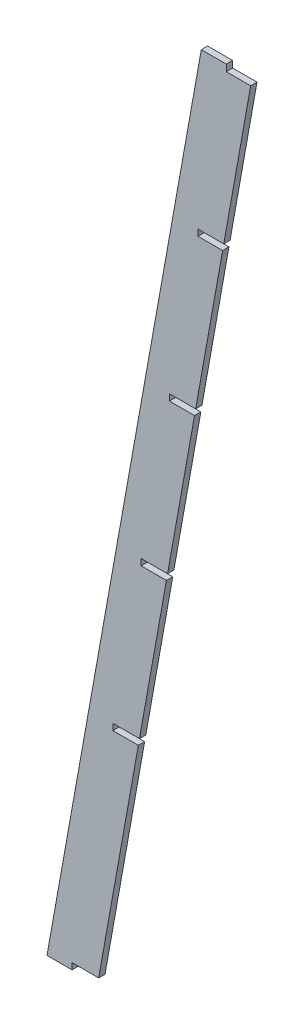
ISO-10303-21;
HEADER;
FILE_DESCRIPTION(('STEP AP214'),'2;1');
FILE_NAME('part.step','',(''),(''),'','','');
FILE_SCHEMA(('AUTOMOTIVE_DESIGN { 1 0 10303 214 1 1 1 1 }'));
ENDSEC;
DATA;
#1=APPLICATION_CONTEXT('core data for automotive mechanical design processes');
#2=APPLICATION_PROTOCOL_DEFINITION('international standard','automotive_design',2000,#1);
#3=PRODUCT_CONTEXT('',#1,'mechanical');
#4=PRODUCT('Part','Part','',(#3));
#5=PRODUCT_RELATED_PRODUCT_CATEGORY('part','',(#4));
#6=PRODUCT_DEFINITION_FORMATION('','',#4);
#7=PRODUCT_DEFINITION_CONTEXT('part definition',#1,'design');
#8=PRODUCT_DEFINITION('design','',#6,#7);
#9=PRODUCT_DEFINITION_SHAPE('','',#8);
#10=(LENGTH_UNIT() NAMED_UNIT(*) SI_UNIT(.MILLI.,.METRE.));
#11=(NAMED_UNIT(*) PLANE_ANGLE_UNIT() SI_UNIT($,.RADIAN.));
#12=(NAMED_UNIT(*) SI_UNIT($,.STERADIAN.) SOLID_ANGLE_UNIT());
#13=UNCERTAINTY_MEASURE_WITH_UNIT(LENGTH_MEASURE(1.E-05),#10,'distance_accuracy_value','');
#14=(GEOMETRIC_REPRESENTATION_CONTEXT(3) GLOBAL_UNCERTAINTY_ASSIGNED_CONTEXT((#13)) GLOBAL_UNIT_ASSIGNED_CONTEXT((#10,
#11,#12)) REPRESENTATION_CONTEXT('',''));
#15=CARTESIAN_POINT('',(0.,0.,0.));
#16=DIRECTION('',(0.,0.,1.));
#17=DIRECTION('',(1.,0.,0.));
#18=AXIS2_PLACEMENT_3D('',#15,#16,#17);
#19=CARTESIAN_POINT('',(24.6106079912229,-4.40765439654902,0.));
#20=DIRECTION('',(-0.984338140304232,0.17629074151074,0.));
#21=DIRECTION('',(-0.17629074151074,-0.984338140304232,0.));
#22=AXIS2_PLACEMENT_3D('',#19,#20,#21);
#23=PLANE('',#22);
#24=DIRECTION('',(0.17629074151074,0.984338140304232,0.));
#25=VECTOR('',#24,1.);
#26=CARTESIAN_POINT('',(25.4,0.,0.));
#27=LINE('',#26,#25);
#28=CARTESIAN_POINT('',(60.5412654139754,196.215,0.));
#29=VERTEX_POINT('',#28);
#30=CARTESIAN_POINT('',(74.0746330005872,271.78,0.));
#31=VERTEX_POINT('',#30);
#32=EDGE_CURVE('E409',#29,#31,#27,.T.);
#33=ORIENTED_EDGE('',*,*,#32,.F.);
#34=DIRECTION('',(0.,0.,1.));
#35=VECTOR('',#34,1.);
#36=CARTESIAN_POINT('',(60.5412654139754,196.215,-5.08));
#37=LINE('',#36,#35);
#38=CARTESIAN_POINT('',(60.5412654139754,196.215,-3.175));
#39=VERTEX_POINT('',#38);
#40=EDGE_CURVE('E647',#39,#29,#37,.T.);
#41=ORIENTED_EDGE('',*,*,#40,.F.);
#42=DIRECTION('',(0.17629074151074,0.984338140304232,0.));
#43=VECTOR('',#42,1.);
#44=CARTESIAN_POINT('',(25.4,0.,-3.175));
#45=LINE('',#44,#43);
#46=CARTESIAN_POINT('',(74.0746330005872,271.78,-3.175));
#47=VERTEX_POINT('',#46);
#48=EDGE_CURVE('E435',#39,#47,#45,.T.);
#49=ORIENTED_EDGE('',*,*,#48,.T.);
#50=DIRECTION('',(0.,0.,1.));
#51=VECTOR('',#50,1.);
#52=CARTESIAN_POINT('',(74.0746330005872,271.78,-5.08));
#53=LINE('',#52,#51);
#54=EDGE_CURVE('E571',#47,#31,#53,.T.);
#55=ORIENTED_EDGE('',*,*,#54,.T.);
#56=EDGE_LOOP('',(#33,#41,#49,#55));
#57=FACE_BOUND('',#56,.T.);
#58=ADVANCED_FACE('F53',(#57),#23,.F.);
#59=CARTESIAN_POINT('',(46.4392689371697,117.475,-3.175));
#60=VERTEX_POINT('',#59);
#61=CARTESIAN_POINT('',(59.9726365237816,193.04,-3.175));
#62=VERTEX_POINT('',#61);
#63=EDGE_CURVE('E426',#60,#62,#45,.T.);
#64=ORIENTED_EDGE('',*,*,#63,.T.);
#65=DIRECTION('',(0.,0.,1.));
#66=VECTOR('',#65,1.);
#67=CARTESIAN_POINT('',(59.9726365237816,193.04,-5.08));
#68=LINE('',#67,#66);
#69=CARTESIAN_POINT('',(59.9726365237816,193.04,0.));
#70=VERTEX_POINT('',#69);
#71=EDGE_CURVE('E671',#62,#70,#68,.T.);
#72=ORIENTED_EDGE('',*,*,#71,.T.);
#73=CARTESIAN_POINT('',(46.4392689371697,117.475,0.));
#74=VERTEX_POINT('',#73);
#75=EDGE_CURVE('E393',#74,#70,#27,.T.);
#76=ORIENTED_EDGE('',*,*,#75,.F.);
#77=DIRECTION('',(0.,0.,1.));
#78=VECTOR('',#77,1.);
#79=CARTESIAN_POINT('',(46.4392689371697,117.475,-5.08));
#80=LINE('',#79,#78);
#81=EDGE_CURVE('E593',#60,#74,#80,.T.);
#82=ORIENTED_EDGE('',*,*,#81,.F.);
#83=EDGE_LOOP('',(#64,#72,#76,#82));
#84=FACE_BOUND('',#83,.T.);
#85=ADVANCED_FACE('F541',(#84),#23,.F.);
#86=CARTESIAN_POINT('',(74.643261890781,274.955,0.));
#87=VERTEX_POINT('',#86);
#88=CARTESIAN_POINT('',(88.1900954272428,350.595188565884,0.));
#89=VERTEX_POINT('',#88);
#90=EDGE_CURVE('E412',#87,#89,#27,.T.);
#91=ORIENTED_EDGE('',*,*,#90,.F.);
#92=DIRECTION('',(0.,0.,1.));
#93=VECTOR('',#92,1.);
#94=CARTESIAN_POINT('',(74.643261890781,274.955,-5.08));
#95=LINE('',#94,#93);
#96=CARTESIAN_POINT('',(74.643261890781,274.955,-3.175));
#97=VERTEX_POINT('',#96);
#98=EDGE_CURVE('E599',#97,#87,#95,.T.);
#99=ORIENTED_EDGE('',*,*,#98,.F.);
#100=CARTESIAN_POINT('',(88.1900954272428,350.595188565884,-3.175));
#101=VERTEX_POINT('',#100);
#102=EDGE_CURVE('E444',#97,#101,#45,.T.);
#103=ORIENTED_EDGE('',*,*,#102,.T.);
#104=DIRECTION('',(0.,0.,1.));
#105=VECTOR('',#104,1.);
#106=CARTESIAN_POINT('',(88.1900954272428,350.595188565884,-5.08));
#107=LINE('',#106,#105);
#108=EDGE_CURVE('E613',#101,#89,#107,.T.);
#109=ORIENTED_EDGE('',*,*,#108,.T.);
#110=EDGE_LOOP('',(#91,#99,#103,#109));
#111=FACE_BOUND('',#110,.T.);
#112=ADVANCED_FACE('F546',(#111),#23,.F.);
#113=CARTESIAN_POINT('',(25.9686288901938,3.17500000000003,0.));
#114=VERTEX_POINT('',#113);
#115=CARTESIAN_POINT('',(45.8706400469759,114.3,0.));
#116=VERTEX_POINT('',#115);
#117=EDGE_CURVE('E387',#114,#116,#27,.T.);
#118=ORIENTED_EDGE('',*,*,#117,.F.);
#119=DIRECTION('',(0.,0.,1.));
#120=VECTOR('',#119,1.);
#121=CARTESIAN_POINT('',(25.9686288901938,3.17500000000003,-5.08));
#122=LINE('',#121,#120);
#123=CARTESIAN_POINT('',(25.9686288901938,3.17500000000003,-3.175));
#124=VERTEX_POINT('',#123);
#125=EDGE_CURVE('E237',#124,#114,#122,.T.);
#126=ORIENTED_EDGE('',*,*,#125,.F.);
#127=CARTESIAN_POINT('',(45.8706400469759,114.3,-3.175));
#128=VERTEX_POINT('',#127);
#129=EDGE_CURVE('E420',#124,#128,#45,.T.);
#130=ORIENTED_EDGE('',*,*,#129,.T.);
#131=DIRECTION('',(0.,0.,1.));
#132=VECTOR('',#131,1.);
#133=CARTESIAN_POINT('',(45.8706400469759,114.3,-5.08));
#134=LINE('',#133,#132);
#135=EDGE_CURVE('E560',#128,#116,#134,.T.);
#136=ORIENTED_EDGE('',*,*,#135,.T.);
#137=EDGE_LOOP('',(#118,#126,#130,#136));
#138=FACE_BOUND('',#137,.T.);
#139=ADVANCED_FACE('F550',(#138),#23,.F.);
#140=CARTESIAN_POINT('',(0.,432.562,0.));
#141=DIRECTION('',(0.,-1.,0.));
#142=DIRECTION('',(0.,0.,-1.));
#143=AXIS2_PLACEMENT_3D('',#140,#141,#142);
#144=PLANE('',#143);
#145=DIRECTION('',(1.,0.,0.));
#146=VECTOR('',#145,1.);
#147=CARTESIAN_POINT('',(77.47,432.562,0.));
#148=LINE('',#147,#146);
#149=CARTESIAN_POINT('',(77.47,432.562,0.));
#150=VERTEX_POINT('',#149);
#151=CARTESIAN_POINT('',(90.0287176521113,432.562,0.));
#152=VERTEX_POINT('',#151);
#153=EDGE_CURVE('E58',#150,#152,#148,.T.);
#154=ORIENTED_EDGE('',*,*,#153,.T.);
#155=DIRECTION('',(0.,0.,1.));
#156=VECTOR('',#155,1.);
#157=CARTESIAN_POINT('',(90.0287176521113,432.562,-5.08));
#158=LINE('',#157,#156);
#159=CARTESIAN_POINT('',(90.0287176521113,432.562,-3.175));
#160=VERTEX_POINT('',#159);
#161=EDGE_CURVE('E217',#160,#152,#158,.T.);
#162=ORIENTED_EDGE('',*,*,#161,.F.);
#163=DIRECTION('',(-1.,0.,0.));
#164=VECTOR('',#163,1.);
#165=CARTESIAN_POINT('',(77.47,432.562,-3.175));
#166=LINE('',#165,#164);
#167=CARTESIAN_POINT('',(77.47,432.562,-3.175));
#168=VERTEX_POINT('',#167);
#169=EDGE_CURVE('E245',#160,#168,#166,.T.);
#170=ORIENTED_EDGE('',*,*,#169,.T.);
#171=DIRECTION('',(0.,0.,1.));
#172=VECTOR('',#171,1.);
#173=CARTESIAN_POINT('',(77.47,432.562,0.));
#174=LINE('',#173,#172);
#175=EDGE_CURVE('E241',#168,#150,#174,.T.);
#176=ORIENTED_EDGE('',*,*,#175,.T.);
#177=EDGE_LOOP('',(#154,#162,#170,#176));
#178=FACE_BOUND('',#177,.T.);
#179=ADVANCED_FACE('F55',(#178),#144,.F.);
#180=CARTESIAN_POINT('',(0.,0.,0.));
#181=DIRECTION('',(0.,-1.,0.));
#182=DIRECTION('',(0.,0.,-1.));
#183=AXIS2_PLACEMENT_3D('',#180,#181,#182);
#184=PLANE('',#183);
#185=DIRECTION('',(0.,0.,1.));
#186=VECTOR('',#185,1.);
#187=CARTESIAN_POINT('',(12.5729093566815,0.,-5.08));
#188=LINE('',#187,#186);
#189=CARTESIAN_POINT('',(12.5729093566815,0.,-3.175));
#190=VERTEX_POINT('',#189);
#191=CARTESIAN_POINT('',(12.5729093566815,0.,0.));
#192=VERTEX_POINT('',#191);
#193=EDGE_CURVE('E474',#190,#192,#188,.T.);
#194=ORIENTED_EDGE('',*,*,#193,.T.);
#195=DIRECTION('',(1.,0.,0.));
#196=VECTOR('',#195,1.);
#197=CARTESIAN_POINT('',(0.,0.,0.));
#198=LINE('',#197,#196);
#199=CARTESIAN_POINT('',(0.,0.,0.));
#200=VERTEX_POINT('',#199);
#201=EDGE_CURVE('E265',#200,#192,#198,.T.);
#202=ORIENTED_EDGE('',*,*,#201,.F.);
#203=DIRECTION('',(0.,0.,1.));
#204=VECTOR('',#203,1.);
#205=CARTESIAN_POINT('',(0.,0.,0.));
#206=LINE('',#205,#204);
#207=CARTESIAN_POINT('',(0.,0.,-3.175));
#208=VERTEX_POINT('',#207);
#209=EDGE_CURVE('E290',#208,#200,#206,.T.);
#210=ORIENTED_EDGE('',*,*,#209,.F.);
#211=DIRECTION('',(-1.,0.,0.));
#212=VECTOR('',#211,1.);
#213=CARTESIAN_POINT('',(0.,0.,-3.175));
#214=LINE('',#213,#212);
#215=EDGE_CURVE('E272',#190,#208,#214,.T.);
#216=ORIENTED_EDGE('',*,*,#215,.F.);
#217=EDGE_LOOP('',(#194,#202,#210,#216));
#218=FACE_BOUND('',#217,.T.);
#219=ADVANCED_FACE('F292',(#218),#184,.T.);
#220=CARTESIAN_POINT('',(88.7529746008909,353.738084410876,-3.175));
#221=VERTEX_POINT('',#220);
#222=CARTESIAN_POINT('',(102.278625954198,429.26,-3.175));
#223=VERTEX_POINT('',#222);
#224=EDGE_CURVE('E271',#221,#223,#45,.T.);
#225=ORIENTED_EDGE('',*,*,#224,.T.);
#226=DIRECTION('',(0.,0.,1.));
#227=VECTOR('',#226,1.);
#228=CARTESIAN_POINT('',(102.278625954198,429.26,-5.08));
#229=LINE('',#228,#227);
#230=CARTESIAN_POINT('',(102.278625954198,429.26,0.));
#231=VERTEX_POINT('',#230);
#232=EDGE_CURVE('E454',#223,#231,#229,.T.);
#233=ORIENTED_EDGE('',*,*,#232,.T.);
#234=CARTESIAN_POINT('',(88.7529746008909,353.738084410876,0.));
#235=VERTEX_POINT('',#234);
#236=EDGE_CURVE('E404',#235,#231,#27,.T.);
#237=ORIENTED_EDGE('',*,*,#236,.F.);
#238=DIRECTION('',(0.,0.,1.));
#239=VECTOR('',#238,1.);
#240=CARTESIAN_POINT('',(88.7529746008909,353.738084410876,-5.08));
#241=LINE('',#240,#239);
#242=EDGE_CURVE('E455',#221,#235,#241,.T.);
#243=ORIENTED_EDGE('',*,*,#242,.F.);
#244=EDGE_LOOP('',(#225,#233,#237,#243));
#245=FACE_BOUND('',#244,.T.);
#246=ADVANCED_FACE('F302',(#245),#23,.F.);
#247=CARTESIAN_POINT('',(0.,0.,0.));
#248=DIRECTION('',(0.,0.,-1.));
#249=DIRECTION('',(-1.,0.,0.));
#250=AXIS2_PLACEMENT_3D('',#247,#248,#249);
#251=PLANE('',#250);
#252=ORIENTED_EDGE('',*,*,#236,.T.);
#253=DIRECTION('',(1.,0.,0.));
#254=VECTOR('',#253,1.);
#255=CARTESIAN_POINT('',(102.278625954198,429.26,0.));
#256=LINE('',#255,#254);
#257=CARTESIAN_POINT('',(90.0287176521113,429.26,0.));
#258=VERTEX_POINT('',#257);
#259=EDGE_CURVE('E227',#258,#231,#256,.T.);
#260=ORIENTED_EDGE('',*,*,#259,.F.);
#261=DIRECTION('',(0.,-1.,0.));
#262=VECTOR('',#261,1.);
#263=CARTESIAN_POINT('',(90.0287176521113,432.562,0.));
#264=LINE('',#263,#262);
#265=EDGE_CURVE('E220',#152,#258,#264,.T.);
#266=ORIENTED_EDGE('',*,*,#265,.F.);
#267=ORIENTED_EDGE('',*,*,#153,.F.);
#268=DIRECTION('',(0.17629074151074,0.984338140304232,0.));
#269=VECTOR('',#268,1.);
#270=CARTESIAN_POINT('',(0.,0.,0.));
#271=LINE('',#270,#269);
#272=EDGE_CURVE('E481',#200,#150,#271,.T.);
#273=ORIENTED_EDGE('',*,*,#272,.F.);
#274=ORIENTED_EDGE('',*,*,#201,.T.);
#275=DIRECTION('',(0.,-1.,0.));
#276=VECTOR('',#275,1.);
#277=CARTESIAN_POINT('',(12.5729093566815,3.17500000000003,0.));
#278=LINE('',#277,#276);
#279=CARTESIAN_POINT('',(12.5729093566815,3.17500000000003,0.));
#280=VERTEX_POINT('',#279);
#281=EDGE_CURVE('E567',#280,#192,#278,.T.);
#282=ORIENTED_EDGE('',*,*,#281,.F.);
#283=DIRECTION('',(-1.,0.,0.));
#284=VECTOR('',#283,1.);
#285=CARTESIAN_POINT('',(25.9686288901938,3.17500000000003,0.));
#286=LINE('',#285,#284);
#287=EDGE_CURVE('E566',#114,#280,#286,.T.);
#288=ORIENTED_EDGE('',*,*,#287,.F.);
#289=ORIENTED_EDGE('',*,*,#117,.T.);
#290=DIRECTION('',(1.,0.,0.));
#291=VECTOR('',#290,1.);
#292=CARTESIAN_POINT('',(33.0714242585586,114.3,0.));
#293=LINE('',#292,#291);
#294=CARTESIAN_POINT('',(33.0714242585586,114.3,0.));
#295=VERTEX_POINT('',#294);
#296=EDGE_CURVE('E564',#295,#116,#293,.T.);
#297=ORIENTED_EDGE('',*,*,#296,.F.);
#298=DIRECTION('',(0.,-1.,0.));
#299=VECTOR('',#298,1.);
#300=CARTESIAN_POINT('',(33.0714242585586,117.475,0.));
#301=LINE('',#300,#299);
#302=CARTESIAN_POINT('',(33.0714242585586,117.475,0.));
#303=VERTEX_POINT('',#302);
#304=EDGE_CURVE('E622',#303,#295,#301,.T.);
#305=ORIENTED_EDGE('',*,*,#304,.F.);
#306=DIRECTION('',(-1.,0.,0.));
#307=VECTOR('',#306,1.);
#308=CARTESIAN_POINT('',(46.4392689371697,117.475,0.));
#309=LINE('',#308,#307);
#310=EDGE_CURVE('E615',#74,#303,#309,.T.);
#311=ORIENTED_EDGE('',*,*,#310,.F.);
#312=ORIENTED_EDGE('',*,*,#75,.T.);
#313=DIRECTION('',(1.,0.,0.));
#314=VECTOR('',#313,1.);
#315=CARTESIAN_POINT('',(59.9726365237816,193.04,0.));
#316=LINE('',#315,#314);
#317=CARTESIAN_POINT('',(47.2603980488849,193.04,0.));
#318=VERTEX_POINT('',#317);
#319=EDGE_CURVE('E668',#318,#70,#316,.T.);
#320=ORIENTED_EDGE('',*,*,#319,.F.);
#321=DIRECTION('',(0.,-1.,0.));
#322=VECTOR('',#321,1.);
#323=CARTESIAN_POINT('',(47.2603980488849,193.04,0.));
#324=LINE('',#323,#322);
#325=CARTESIAN_POINT('',(47.2603980488849,196.215,0.));
#326=VERTEX_POINT('',#325);
#327=EDGE_CURVE('E678',#326,#318,#324,.T.);
#328=ORIENTED_EDGE('',*,*,#327,.F.);
#329=DIRECTION('',(-1.,0.,0.));
#330=VECTOR('',#329,1.);
#331=CARTESIAN_POINT('',(47.2603980488849,196.215,0.));
#332=LINE('',#331,#330);
#333=EDGE_CURVE('E470',#29,#326,#332,.T.);
#334=ORIENTED_EDGE('',*,*,#333,.F.);
#335=ORIENTED_EDGE('',*,*,#32,.T.);
#336=DIRECTION('',(1.,0.,0.));
#337=VECTOR('',#336,1.);
#338=CARTESIAN_POINT('',(61.4708714216666,271.78,0.));
#339=LINE('',#338,#337);
#340=CARTESIAN_POINT('',(61.4708714216666,271.78,0.));
#341=VERTEX_POINT('',#340);
#342=EDGE_CURVE('E597',#341,#31,#339,.T.);
#343=ORIENTED_EDGE('',*,*,#342,.F.);
#344=DIRECTION('',(0.,-1.,0.));
#345=VECTOR('',#344,1.);
#346=CARTESIAN_POINT('',(61.4708714216666,274.955,0.));
#347=LINE('',#346,#345);
#348=CARTESIAN_POINT('',(61.4708714216666,274.955,0.));
#349=VERTEX_POINT('',#348);
#350=EDGE_CURVE('E592',#349,#341,#347,.T.);
#351=ORIENTED_EDGE('',*,*,#350,.F.);
#352=DIRECTION('',(-1.,0.,0.));
#353=VECTOR('',#352,1.);
#354=CARTESIAN_POINT('',(74.643261890781,274.955,0.));
#355=LINE('',#354,#353);
#356=EDGE_CURVE('E588',#87,#349,#355,.T.);
#357=ORIENTED_EDGE('',*,*,#356,.F.);
#358=ORIENTED_EDGE('',*,*,#90,.T.);
#359=DIRECTION('',(1.,0.,0.));
#360=VECTOR('',#359,1.);
#361=CARTESIAN_POINT('',(75.7597219172466,350.595188565884,0.));
#362=LINE('',#361,#360);
#363=CARTESIAN_POINT('',(75.7597219172466,350.595188565884,0.));
#364=VERTEX_POINT('',#363);
#365=EDGE_CURVE('E627',#364,#89,#362,.T.);
#366=ORIENTED_EDGE('',*,*,#365,.F.);
#367=DIRECTION('',(0.,-1.,0.));
#368=VECTOR('',#367,1.);
#369=CARTESIAN_POINT('',(75.7597219172466,353.738084410876,0.));
#370=LINE('',#369,#368);
#371=CARTESIAN_POINT('',(75.7597219172466,353.738084410876,0.));
#372=VERTEX_POINT('',#371);
#373=EDGE_CURVE('E639',#372,#364,#370,.T.);
#374=ORIENTED_EDGE('',*,*,#373,.F.);
#375=DIRECTION('',(-1.,0.,0.));
#376=VECTOR('',#375,1.);
#377=CARTESIAN_POINT('',(75.7597219172466,353.738084410876,0.));
#378=LINE('',#377,#376);
#379=EDGE_CURVE('E642',#235,#372,#378,.T.);
#380=ORIENTED_EDGE('',*,*,#379,.F.);
#381=EDGE_LOOP('',(#252,#260,#266,#267,#273,#274,#282,#288,#289,#297,#305,#311,#312,#320,#328,
#334,#335,#343,#351,#357,#358,#366,#374,#380));
#382=FACE_BOUND('',#381,.T.);
#383=ADVANCED_FACE('F232',(#382),#251,.F.);
#384=CARTESIAN_POINT('',(0.,0.,-3.175));
#385=DIRECTION('',(0.,0.,1.));
#386=DIRECTION('',(1.,0.,0.));
#387=AXIS2_PLACEMENT_3D('',#384,#385,#386);
#388=PLANE('',#387);
#389=DIRECTION('',(0.,-1.,0.));
#390=VECTOR('',#389,1.);
#391=CARTESIAN_POINT('',(90.0287176521113,0.,-3.175));
#392=LINE('',#391,#390);
#393=CARTESIAN_POINT('',(90.0287176521113,429.26,-3.175));
#394=VERTEX_POINT('',#393);
#395=EDGE_CURVE('E65',#160,#394,#392,.T.);
#396=ORIENTED_EDGE('',*,*,#395,.T.);
#397=DIRECTION('',(1.,0.,0.));
#398=VECTOR('',#397,1.);
#399=CARTESIAN_POINT('',(0.,429.26,-3.175));
#400=LINE('',#399,#398);
#401=EDGE_CURVE('E12',#394,#223,#400,.T.);
#402=ORIENTED_EDGE('',*,*,#401,.T.);
#403=ORIENTED_EDGE('',*,*,#224,.F.);
#404=DIRECTION('',(-1.,0.,0.));
#405=VECTOR('',#404,1.);
#406=CARTESIAN_POINT('',(0.,353.738084410876,-3.175));
#407=LINE('',#406,#405);
#408=CARTESIAN_POINT('',(75.7597219172466,353.738084410876,-3.175));
#409=VERTEX_POINT('',#408);
#410=EDGE_CURVE('E244',#221,#409,#407,.T.);
#411=ORIENTED_EDGE('',*,*,#410,.T.);
#412=DIRECTION('',(0.,-1.,0.));
#413=VECTOR('',#412,1.);
#414=CARTESIAN_POINT('',(75.7597219172466,0.,-3.175));
#415=LINE('',#414,#413);
#416=CARTESIAN_POINT('',(75.7597219172466,350.595188565884,-3.175));
#417=VERTEX_POINT('',#416);
#418=EDGE_CURVE('E329',#409,#417,#415,.T.);
#419=ORIENTED_EDGE('',*,*,#418,.T.);
#420=DIRECTION('',(1.,0.,0.));
#421=VECTOR('',#420,1.);
#422=CARTESIAN_POINT('',(0.,350.595188565884,-3.175));
#423=LINE('',#422,#421);
#424=EDGE_CURVE('E333',#417,#101,#423,.T.);
#425=ORIENTED_EDGE('',*,*,#424,.T.);
#426=ORIENTED_EDGE('',*,*,#102,.F.);
#427=DIRECTION('',(-1.,0.,0.));
#428=VECTOR('',#427,1.);
#429=CARTESIAN_POINT('',(0.,274.955,-3.175));
#430=LINE('',#429,#428);
#431=CARTESIAN_POINT('',(61.4708714216666,274.955,-3.175));
#432=VERTEX_POINT('',#431);
#433=EDGE_CURVE('E349',#97,#432,#430,.T.);
#434=ORIENTED_EDGE('',*,*,#433,.T.);
#435=DIRECTION('',(0.,-1.,0.));
#436=VECTOR('',#435,1.);
#437=CARTESIAN_POINT('',(61.4708714216666,0.,-3.175));
#438=LINE('',#437,#436);
#439=CARTESIAN_POINT('',(61.4708714216666,271.78,-3.175));
#440=VERTEX_POINT('',#439);
#441=EDGE_CURVE('E353',#432,#440,#438,.T.);
#442=ORIENTED_EDGE('',*,*,#441,.T.);
#443=DIRECTION('',(1.,0.,0.));
#444=VECTOR('',#443,1.);
#445=CARTESIAN_POINT('',(0.,271.78,-3.175));
#446=LINE('',#445,#444);
#447=EDGE_CURVE('E357',#440,#47,#446,.T.);
#448=ORIENTED_EDGE('',*,*,#447,.T.);
#449=ORIENTED_EDGE('',*,*,#48,.F.);
#450=DIRECTION('',(-1.,0.,0.));
#451=VECTOR('',#450,1.);
#452=CARTESIAN_POINT('',(0.,196.215,-3.175));
#453=LINE('',#452,#451);
#454=CARTESIAN_POINT('',(47.2603980488849,196.215,-3.175));
#455=VERTEX_POINT('',#454);
#456=EDGE_CURVE('E379',#39,#455,#453,.T.);
#457=ORIENTED_EDGE('',*,*,#456,.T.);
#458=DIRECTION('',(0.,-1.,0.));
#459=VECTOR('',#458,1.);
#460=CARTESIAN_POINT('',(47.2603980488849,0.,-3.175));
#461=LINE('',#460,#459);
#462=CARTESIAN_POINT('',(47.2603980488849,193.04,-3.175));
#463=VERTEX_POINT('',#462);
#464=EDGE_CURVE('E371',#455,#463,#461,.T.);
#465=ORIENTED_EDGE('',*,*,#464,.T.);
#466=DIRECTION('',(1.,0.,0.));
#467=VECTOR('',#466,1.);
#468=CARTESIAN_POINT('',(0.,193.04,-3.175));
#469=LINE('',#468,#467);
#470=EDGE_CURVE('E375',#463,#62,#469,.T.);
#471=ORIENTED_EDGE('',*,*,#470,.T.);
#472=ORIENTED_EDGE('',*,*,#63,.F.);
#473=DIRECTION('',(-1.,0.,0.));
#474=VECTOR('',#473,1.);
#475=CARTESIAN_POINT('',(0.,117.475,-3.175));
#476=LINE('',#475,#474);
#477=CARTESIAN_POINT('',(33.0714242585586,117.475,-3.175));
#478=VERTEX_POINT('',#477);
#479=EDGE_CURVE('E345',#60,#478,#476,.T.);
#480=ORIENTED_EDGE('',*,*,#479,.T.);
#481=DIRECTION('',(0.,-1.,0.));
#482=VECTOR('',#481,1.);
#483=CARTESIAN_POINT('',(33.0714242585586,0.,-3.175));
#484=LINE('',#483,#482);
#485=CARTESIAN_POINT('',(33.0714242585586,114.3,-3.175));
#486=VERTEX_POINT('',#485);
#487=EDGE_CURVE('E337',#478,#486,#484,.T.);
#488=ORIENTED_EDGE('',*,*,#487,.T.);
#489=DIRECTION('',(1.,0.,0.));
#490=VECTOR('',#489,1.);
#491=CARTESIAN_POINT('',(0.,114.3,-3.175));
#492=LINE('',#491,#490);
#493=EDGE_CURVE('E341',#486,#128,#492,.T.);
#494=ORIENTED_EDGE('',*,*,#493,.T.);
#495=ORIENTED_EDGE('',*,*,#129,.F.);
#496=DIRECTION('',(-1.,0.,0.));
#497=VECTOR('',#496,1.);
#498=CARTESIAN_POINT('',(0.,3.17500000000003,-3.175));
#499=LINE('',#498,#497);
#500=CARTESIAN_POINT('',(12.5729093566815,3.17500000000003,-3.175));
#501=VERTEX_POINT('',#500);
#502=EDGE_CURVE('E365',#124,#501,#499,.T.);
#503=ORIENTED_EDGE('',*,*,#502,.T.);
#504=DIRECTION('',(0.,-1.,0.));
#505=VECTOR('',#504,1.);
#506=CARTESIAN_POINT('',(12.5729093566815,0.,-3.175));
#507=LINE('',#506,#505);
#508=EDGE_CURVE('E361',#501,#190,#507,.T.);
#509=ORIENTED_EDGE('',*,*,#508,.T.);
#510=ORIENTED_EDGE('',*,*,#215,.T.);
#511=DIRECTION('',(0.17629074151074,0.984338140304232,0.));
#512=VECTOR('',#511,1.);
#513=CARTESIAN_POINT('',(0.,0.,-3.175));
#514=LINE('',#513,#512);
#515=EDGE_CURVE('E392',#208,#168,#514,.T.);
#516=ORIENTED_EDGE('',*,*,#515,.T.);
#517=ORIENTED_EDGE('',*,*,#169,.F.);
#518=EDGE_LOOP('',(#396,#402,#403,#411,#419,#425,#426,#434,#442,#448,#449,#457,#465,#471,#472,
#480,#488,#494,#495,#503,#509,#510,#516,#517));
#519=FACE_BOUND('',#518,.T.);
#520=ADVANCED_FACE('F457',(#519),#388,.F.);
#521=CARTESIAN_POINT('',(0.,0.,0.));
#522=DIRECTION('',(0.984338140304232,-0.17629074151074,0.));
#523=DIRECTION('',(0.17629074151074,0.984338140304232,0.));
#524=AXIS2_PLACEMENT_3D('',#521,#522,#523);
#525=PLANE('',#524);
#526=ORIENTED_EDGE('',*,*,#272,.T.);
#527=ORIENTED_EDGE('',*,*,#175,.F.);
#528=ORIENTED_EDGE('',*,*,#515,.F.);
#529=ORIENTED_EDGE('',*,*,#209,.T.);
#530=EDGE_LOOP('',(#526,#527,#528,#529));
#531=FACE_BOUND('',#530,.T.);
#532=ADVANCED_FACE('F511',(#531),#525,.F.);
#533=CARTESIAN_POINT('',(75.7597219172466,350.595188565884,-5.08));
#534=DIRECTION('',(0.,-1.,0.));
#535=DIRECTION('',(0.,0.,-1.));
#536=AXIS2_PLACEMENT_3D('',#533,#534,#535);
#537=PLANE('',#536);
#538=DIRECTION('',(0.,0.,1.));
#539=VECTOR('',#538,1.);
#540=CARTESIAN_POINT('',(75.7597219172466,350.595188565884,-5.08));
#541=LINE('',#540,#539);
#542=EDGE_CURVE('E616',#417,#364,#541,.T.);
#543=ORIENTED_EDGE('',*,*,#542,.T.);
#544=ORIENTED_EDGE('',*,*,#365,.T.);
#545=ORIENTED_EDGE('',*,*,#108,.F.);
#546=ORIENTED_EDGE('',*,*,#424,.F.);
#547=EDGE_LOOP('',(#543,#544,#545,#546));
#548=FACE_BOUND('',#547,.T.);
#549=ADVANCED_FACE('F531',(#548),#537,.F.);
#550=CARTESIAN_POINT('',(75.7597219172466,353.738084410876,-5.08));
#551=DIRECTION('',(-1.,0.,0.));
#552=DIRECTION('',(0.,0.,1.));
#553=AXIS2_PLACEMENT_3D('',#550,#551,#552);
#554=PLANE('',#553);
#555=DIRECTION('',(0.,0.,1.));
#556=VECTOR('',#555,1.);
#557=CARTESIAN_POINT('',(75.7597219172466,353.738084410876,-5.08));
#558=LINE('',#557,#556);
#559=EDGE_CURVE('E624',#409,#372,#558,.T.);
#560=ORIENTED_EDGE('',*,*,#559,.T.);
#561=ORIENTED_EDGE('',*,*,#373,.T.);
#562=ORIENTED_EDGE('',*,*,#542,.F.);
#563=ORIENTED_EDGE('',*,*,#418,.F.);
#564=EDGE_LOOP('',(#560,#561,#562,#563));
#565=FACE_BOUND('',#564,.T.);
#566=ADVANCED_FACE('F537',(#565),#554,.F.);
#567=CARTESIAN_POINT('',(75.7597219172466,353.738084410876,-5.08));
#568=DIRECTION('',(0.,1.,0.));
#569=DIRECTION('',(0.,0.,1.));
#570=AXIS2_PLACEMENT_3D('',#567,#568,#569);
#571=PLANE('',#570);
#572=ORIENTED_EDGE('',*,*,#242,.T.);
#573=ORIENTED_EDGE('',*,*,#379,.T.);
#574=ORIENTED_EDGE('',*,*,#559,.F.);
#575=ORIENTED_EDGE('',*,*,#410,.F.);
#576=EDGE_LOOP('',(#572,#573,#574,#575));
#577=FACE_BOUND('',#576,.T.);
#578=ADVANCED_FACE('F724',(#577),#571,.F.);
#579=CARTESIAN_POINT('',(46.4392689371697,117.475,-5.08));
#580=DIRECTION('',(0.,1.,0.));
#581=DIRECTION('',(0.,0.,1.));
#582=AXIS2_PLACEMENT_3D('',#579,#580,#581);
#583=PLANE('',#582);
#584=ORIENTED_EDGE('',*,*,#81,.T.);
#585=ORIENTED_EDGE('',*,*,#310,.T.);
#586=DIRECTION('',(0.,0.,1.));
#587=VECTOR('',#586,1.);
#588=CARTESIAN_POINT('',(33.0714242585586,117.475,-5.08));
#589=LINE('',#588,#587);
#590=EDGE_CURVE('E650',#478,#303,#589,.T.);
#591=ORIENTED_EDGE('',*,*,#590,.F.);
#592=ORIENTED_EDGE('',*,*,#479,.F.);
#593=EDGE_LOOP('',(#584,#585,#591,#592));
#594=FACE_BOUND('',#593,.T.);
#595=ADVANCED_FACE('F717',(#594),#583,.F.);
#596=CARTESIAN_POINT('',(33.0714242585586,114.3,-5.08));
#597=DIRECTION('',(0.,-1.,0.));
#598=DIRECTION('',(0.,0.,-1.));
#599=AXIS2_PLACEMENT_3D('',#596,#597,#598);
#600=PLANE('',#599);
#601=DIRECTION('',(0.,0.,1.));
#602=VECTOR('',#601,1.);
#603=CARTESIAN_POINT('',(33.0714242585586,114.3,-5.08));
#604=LINE('',#603,#602);
#605=EDGE_CURVE('E653',#486,#295,#604,.T.);
#606=ORIENTED_EDGE('',*,*,#605,.T.);
#607=ORIENTED_EDGE('',*,*,#296,.T.);
#608=ORIENTED_EDGE('',*,*,#135,.F.);
#609=ORIENTED_EDGE('',*,*,#493,.F.);
#610=EDGE_LOOP('',(#606,#607,#608,#609));
#611=FACE_BOUND('',#610,.T.);
#612=ADVANCED_FACE('F713',(#611),#600,.F.);
#613=CARTESIAN_POINT('',(33.0714242585586,117.475,-5.08));
#614=DIRECTION('',(-1.,0.,0.));
#615=DIRECTION('',(0.,0.,1.));
#616=AXIS2_PLACEMENT_3D('',#613,#614,#615);
#617=PLANE('',#616);
#618=ORIENTED_EDGE('',*,*,#590,.T.);
#619=ORIENTED_EDGE('',*,*,#304,.T.);
#620=ORIENTED_EDGE('',*,*,#605,.F.);
#621=ORIENTED_EDGE('',*,*,#487,.F.);
#622=EDGE_LOOP('',(#618,#619,#620,#621));
#623=FACE_BOUND('',#622,.T.);
#624=ADVANCED_FACE('F716',(#623),#617,.F.);
#625=CARTESIAN_POINT('',(61.4708714216666,271.78,-5.08));
#626=DIRECTION('',(0.,-1.,0.));
#627=DIRECTION('',(0.,0.,-1.));
#628=AXIS2_PLACEMENT_3D('',#625,#626,#627);
#629=PLANE('',#628);
#630=DIRECTION('',(0.,0.,1.));
#631=VECTOR('',#630,1.);
#632=CARTESIAN_POINT('',(61.4708714216666,271.78,-5.08));
#633=LINE('',#632,#631);
#634=EDGE_CURVE('E578',#440,#341,#633,.T.);
#635=ORIENTED_EDGE('',*,*,#634,.T.);
#636=ORIENTED_EDGE('',*,*,#342,.T.);
#637=ORIENTED_EDGE('',*,*,#54,.F.);
#638=ORIENTED_EDGE('',*,*,#447,.F.);
#639=EDGE_LOOP('',(#635,#636,#637,#638));
#640=FACE_BOUND('',#639,.T.);
#641=ADVANCED_FACE('F721',(#640),#629,.F.);
#642=CARTESIAN_POINT('',(61.4708714216666,274.955,-5.08));
#643=DIRECTION('',(-1.,0.,0.));
#644=DIRECTION('',(0.,0.,1.));
#645=AXIS2_PLACEMENT_3D('',#642,#643,#644);
#646=PLANE('',#645);
#647=DIRECTION('',(0.,0.,1.));
#648=VECTOR('',#647,1.);
#649=CARTESIAN_POINT('',(61.4708714216666,274.955,-5.08));
#650=LINE('',#649,#648);
#651=EDGE_CURVE('E603',#432,#349,#650,.T.);
#652=ORIENTED_EDGE('',*,*,#651,.T.);
#653=ORIENTED_EDGE('',*,*,#350,.T.);
#654=ORIENTED_EDGE('',*,*,#634,.F.);
#655=ORIENTED_EDGE('',*,*,#441,.F.);
#656=EDGE_LOOP('',(#652,#653,#654,#655));
#657=FACE_BOUND('',#656,.T.);
#658=ADVANCED_FACE('F738',(#657),#646,.F.);
#659=CARTESIAN_POINT('',(74.643261890781,274.955,-5.08));
#660=DIRECTION('',(0.,1.,0.));
#661=DIRECTION('',(0.,0.,1.));
#662=AXIS2_PLACEMENT_3D('',#659,#660,#661);
#663=PLANE('',#662);
#664=ORIENTED_EDGE('',*,*,#98,.T.);
#665=ORIENTED_EDGE('',*,*,#356,.T.);
#666=ORIENTED_EDGE('',*,*,#651,.F.);
#667=ORIENTED_EDGE('',*,*,#433,.F.);
#668=EDGE_LOOP('',(#664,#665,#666,#667));
#669=FACE_BOUND('',#668,.T.);
#670=ADVANCED_FACE('F303',(#669),#663,.F.);
#671=CARTESIAN_POINT('',(25.9686288901938,3.17500000000003,-5.08));
#672=DIRECTION('',(0.,1.,0.));
#673=DIRECTION('',(0.,0.,1.));
#674=AXIS2_PLACEMENT_3D('',#671,#672,#673);
#675=PLANE('',#674);
#676=ORIENTED_EDGE('',*,*,#125,.T.);
#677=ORIENTED_EDGE('',*,*,#287,.T.);
#678=DIRECTION('',(0.,0.,1.));
#679=VECTOR('',#678,1.);
#680=CARTESIAN_POINT('',(12.5729093566815,3.17500000000003,-5.08));
#681=LINE('',#680,#679);
#682=EDGE_CURVE('E576',#501,#280,#681,.T.);
#683=ORIENTED_EDGE('',*,*,#682,.F.);
#684=ORIENTED_EDGE('',*,*,#502,.F.);
#685=EDGE_LOOP('',(#676,#677,#683,#684));
#686=FACE_BOUND('',#685,.T.);
#687=ADVANCED_FACE('F733',(#686),#675,.F.);
#688=CARTESIAN_POINT('',(12.5729093566815,3.17500000000003,-5.08));
#689=DIRECTION('',(-1.,0.,0.));
#690=DIRECTION('',(0.,0.,1.));
#691=AXIS2_PLACEMENT_3D('',#688,#689,#690);
#692=PLANE('',#691);
#693=ORIENTED_EDGE('',*,*,#682,.T.);
#694=ORIENTED_EDGE('',*,*,#281,.T.);
#695=ORIENTED_EDGE('',*,*,#193,.F.);
#696=ORIENTED_EDGE('',*,*,#508,.F.);
#697=EDGE_LOOP('',(#693,#694,#695,#696));
#698=FACE_BOUND('',#697,.T.);
#699=ADVANCED_FACE('F712',(#698),#692,.F.);
#700=CARTESIAN_POINT('',(47.2603980488849,196.215,-5.08));
#701=DIRECTION('',(0.,1.,0.));
#702=DIRECTION('',(0.,0.,1.));
#703=AXIS2_PLACEMENT_3D('',#700,#701,#702);
#704=PLANE('',#703);
#705=ORIENTED_EDGE('',*,*,#40,.T.);
#706=ORIENTED_EDGE('',*,*,#333,.T.);
#707=DIRECTION('',(0.,0.,1.));
#708=VECTOR('',#707,1.);
#709=CARTESIAN_POINT('',(47.2603980488849,196.215,-5.08));
#710=LINE('',#709,#708);
#711=EDGE_CURVE('E665',#455,#326,#710,.T.);
#712=ORIENTED_EDGE('',*,*,#711,.F.);
#713=ORIENTED_EDGE('',*,*,#456,.F.);
#714=EDGE_LOOP('',(#705,#706,#712,#713));
#715=FACE_BOUND('',#714,.T.);
#716=ADVANCED_FACE('F689',(#715),#704,.F.);
#717=CARTESIAN_POINT('',(59.9726365237816,193.04,-5.08));
#718=DIRECTION('',(0.,-1.,0.));
#719=DIRECTION('',(0.,0.,-1.));
#720=AXIS2_PLACEMENT_3D('',#717,#718,#719);
#721=PLANE('',#720);
#722=DIRECTION('',(0.,0.,1.));
#723=VECTOR('',#722,1.);
#724=CARTESIAN_POINT('',(47.2603980488849,193.04,-5.08));
#725=LINE('',#724,#723);
#726=EDGE_CURVE('E81',#463,#318,#725,.T.);
#727=ORIENTED_EDGE('',*,*,#726,.T.);
#728=ORIENTED_EDGE('',*,*,#319,.T.);
#729=ORIENTED_EDGE('',*,*,#71,.F.);
#730=ORIENTED_EDGE('',*,*,#470,.F.);
#731=EDGE_LOOP('',(#727,#728,#729,#730));
#732=FACE_BOUND('',#731,.T.);
#733=ADVANCED_FACE('F695',(#732),#721,.F.);
#734=CARTESIAN_POINT('',(47.2603980488849,193.04,-5.08));
#735=DIRECTION('',(-1.,0.,0.));
#736=DIRECTION('',(0.,0.,1.));
#737=AXIS2_PLACEMENT_3D('',#734,#735,#736);
#738=PLANE('',#737);
#739=ORIENTED_EDGE('',*,*,#711,.T.);
#740=ORIENTED_EDGE('',*,*,#327,.T.);
#741=ORIENTED_EDGE('',*,*,#726,.F.);
#742=ORIENTED_EDGE('',*,*,#464,.F.);
#743=EDGE_LOOP('',(#739,#740,#741,#742));
#744=FACE_BOUND('',#743,.T.);
#745=ADVANCED_FACE('F699',(#744),#738,.F.);
#746=CARTESIAN_POINT('',(102.278625954198,429.26,-5.08));
#747=DIRECTION('',(0.,-1.,0.));
#748=DIRECTION('',(0.,0.,-1.));
#749=AXIS2_PLACEMENT_3D('',#746,#747,#748);
#750=PLANE('',#749);
#751=DIRECTION('',(0.,0.,1.));
#752=VECTOR('',#751,1.);
#753=CARTESIAN_POINT('',(90.0287176521113,429.26,-5.08));
#754=LINE('',#753,#752);
#755=EDGE_CURVE('E73',#394,#258,#754,.T.);
#756=ORIENTED_EDGE('',*,*,#755,.T.);
#757=ORIENTED_EDGE('',*,*,#259,.T.);
#758=ORIENTED_EDGE('',*,*,#232,.F.);
#759=ORIENTED_EDGE('',*,*,#401,.F.);
#760=EDGE_LOOP('',(#756,#757,#758,#759));
#761=FACE_BOUND('',#760,.T.);
#762=ADVANCED_FACE('F459',(#761),#750,.F.);
#763=CARTESIAN_POINT('',(90.0287176521113,432.562,-5.08));
#764=DIRECTION('',(-1.,0.,0.));
#765=DIRECTION('',(0.,0.,1.));
#766=AXIS2_PLACEMENT_3D('',#763,#764,#765);
#767=PLANE('',#766);
#768=ORIENTED_EDGE('',*,*,#161,.T.);
#769=ORIENTED_EDGE('',*,*,#265,.T.);
#770=ORIENTED_EDGE('',*,*,#755,.F.);
#771=ORIENTED_EDGE('',*,*,#395,.F.);
#772=EDGE_LOOP('',(#768,#769,#770,#771));
#773=FACE_BOUND('',#772,.T.);
#774=ADVANCED_FACE('F219',(#773),#767,.F.);
#775=CLOSED_SHELL('',(#58,#85,#112,#139,#179,#219,#246,#383,#520,#532,#549,#566,#578,#595,#612,
#624,#641,#658,#670,#687,#699,#716,#733,#745,#762,#774));
#776=MANIFOLD_SOLID_BREP('B2',#775);
#777=ADVANCED_BREP_SHAPE_REPRESENTATION('',(#18,#776),#14);
#778=SHAPE_DEFINITION_REPRESENTATION(#9,#777);
ENDSEC;
END-ISO-10303-21;
